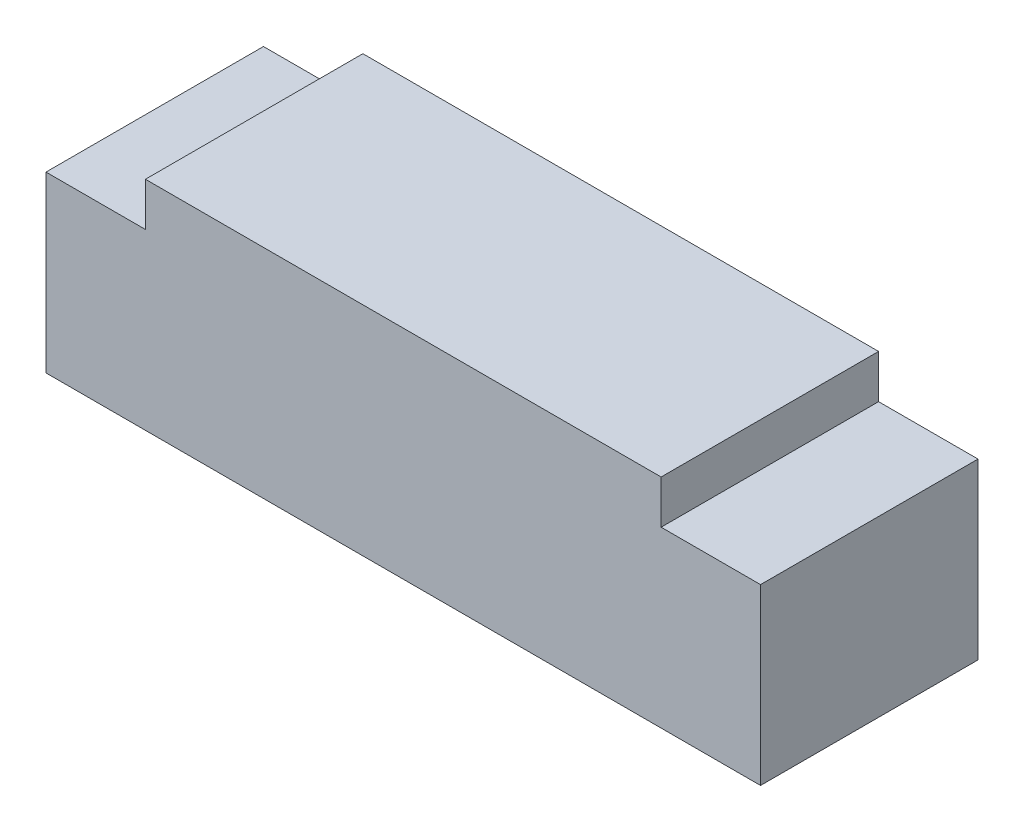
ISO-10303-21;
HEADER;
FILE_DESCRIPTION(('STEP AP214'),'2;1');
FILE_NAME('part.step','',(''),(''),'','','');
FILE_SCHEMA(('AUTOMOTIVE_DESIGN { 1 0 10303 214 1 1 1 1 }'));
ENDSEC;
DATA;
#1=APPLICATION_CONTEXT('core data for automotive mechanical design processes');
#2=APPLICATION_PROTOCOL_DEFINITION('international standard','automotive_design',2000,#1);
#3=PRODUCT_CONTEXT('',#1,'mechanical');
#4=PRODUCT('Part','Part','',(#3));
#5=PRODUCT_RELATED_PRODUCT_CATEGORY('part','',(#4));
#6=PRODUCT_DEFINITION_FORMATION('','',#4);
#7=PRODUCT_DEFINITION_CONTEXT('part definition',#1,'design');
#8=PRODUCT_DEFINITION('design','',#6,#7);
#9=PRODUCT_DEFINITION_SHAPE('','',#8);
#10=(LENGTH_UNIT() NAMED_UNIT(*) SI_UNIT(.MILLI.,.METRE.));
#11=(NAMED_UNIT(*) PLANE_ANGLE_UNIT() SI_UNIT($,.RADIAN.));
#12=(NAMED_UNIT(*) SI_UNIT($,.STERADIAN.) SOLID_ANGLE_UNIT());
#13=UNCERTAINTY_MEASURE_WITH_UNIT(LENGTH_MEASURE(1.E-05),#10,'distance_accuracy_value','');
#14=(GEOMETRIC_REPRESENTATION_CONTEXT(3) GLOBAL_UNCERTAINTY_ASSIGNED_CONTEXT((#13)) GLOBAL_UNIT_ASSIGNED_CONTEXT((#10,
#11,#12)) REPRESENTATION_CONTEXT('',''));
#15=CARTESIAN_POINT('',(0.,0.,0.));
#16=DIRECTION('',(0.,0.,1.));
#17=DIRECTION('',(1.,0.,0.));
#18=AXIS2_PLACEMENT_3D('',#15,#16,#17);
#19=CARTESIAN_POINT('',(0.,5.00000000000402,-19.95));
#20=DIRECTION('',(0.,1.,0.));
#21=DIRECTION('',(1.,0.,0.));
#22=AXIS2_PLACEMENT_3D('',#19,#20,#21);
#23=PLANE('',#22);
#24=DIRECTION('',(-1.,0.,0.));
#25=VECTOR('',#24,1.);
#26=CARTESIAN_POINT('',(5.75,5.00000000000402,-21.7));
#27=LINE('',#26,#25);
#28=CARTESIAN_POINT('',(5.75,5.00000000000402,-21.7));
#29=VERTEX_POINT('',#28);
#30=CARTESIAN_POINT('',(-5.75,5.00000000000402,-21.7));
#31=VERTEX_POINT('',#30);
#32=EDGE_CURVE('E29',#29,#31,#27,.T.);
#33=ORIENTED_EDGE('',*,*,#32,.F.);
#34=DIRECTION('',(0.,0.,-1.));
#35=VECTOR('',#34,1.);
#36=CARTESIAN_POINT('',(5.75,5.00000000000402,-18.2));
#37=LINE('',#36,#35);
#38=CARTESIAN_POINT('',(5.75,5.00000000000402,-18.2));
#39=VERTEX_POINT('',#38);
#40=EDGE_CURVE('E143',#39,#29,#37,.T.);
#41=ORIENTED_EDGE('',*,*,#40,.F.);
#42=DIRECTION('',(-1.,0.,0.));
#43=VECTOR('',#42,1.);
#44=CARTESIAN_POINT('',(-4.15,5.00000000000402,-18.2));
#45=LINE('',#44,#43);
#46=CARTESIAN_POINT('',(-5.75,5.00000000000402,-18.2));
#47=VERTEX_POINT('',#46);
#48=EDGE_CURVE('E150',#39,#47,#45,.T.);
#49=ORIENTED_EDGE('',*,*,#48,.T.);
#50=DIRECTION('',(0.,0.,-1.));
#51=VECTOR('',#50,1.);
#52=CARTESIAN_POINT('',(-5.75,5.00000000000402,-18.2));
#53=LINE('',#52,#51);
#54=EDGE_CURVE('E122',#47,#31,#53,.T.);
#55=ORIENTED_EDGE('',*,*,#54,.T.);
#56=EDGE_LOOP('',(#33,#41,#49,#55));
#57=FACE_BOUND('',#56,.T.);
#58=ADVANCED_FACE('F18',(#57),#23,.F.);
#59=CARTESIAN_POINT('',(0.,8.50000000000401,-19.95));
#60=DIRECTION('',(0.,1.,0.));
#61=DIRECTION('',(1.,0.,0.));
#62=AXIS2_PLACEMENT_3D('',#59,#60,#61);
#63=PLANE('',#62);
#64=DIRECTION('',(-1.,0.,0.));
#65=VECTOR('',#64,1.);
#66=CARTESIAN_POINT('',(5.75,8.50000000000401,-21.7));
#67=LINE('',#66,#65);
#68=CARTESIAN_POINT('',(4.15,8.50000000000401,-21.7));
#69=VERTEX_POINT('',#68);
#70=CARTESIAN_POINT('',(-4.15,8.50000000000401,-21.7));
#71=VERTEX_POINT('',#70);
#72=EDGE_CURVE('E11',#69,#71,#67,.T.);
#73=ORIENTED_EDGE('',*,*,#72,.T.);
#74=DIRECTION('',(0.,0.,1.));
#75=VECTOR('',#74,1.);
#76=CARTESIAN_POINT('',(-4.15,8.50000000000401,-21.7));
#77=LINE('',#76,#75);
#78=CARTESIAN_POINT('',(-4.15,8.50000000000401,-18.2));
#79=VERTEX_POINT('',#78);
#80=EDGE_CURVE('E175',#71,#79,#77,.T.);
#81=ORIENTED_EDGE('',*,*,#80,.T.);
#82=DIRECTION('',(1.,0.,0.));
#83=VECTOR('',#82,1.);
#84=CARTESIAN_POINT('',(-4.15,8.50000000000401,-18.2));
#85=LINE('',#84,#83);
#86=CARTESIAN_POINT('',(4.15,8.50000000000401,-18.2));
#87=VERTEX_POINT('',#86);
#88=EDGE_CURVE('E159',#79,#87,#85,.T.);
#89=ORIENTED_EDGE('',*,*,#88,.T.);
#90=DIRECTION('',(0.,0.,-1.));
#91=VECTOR('',#90,1.);
#92=CARTESIAN_POINT('',(4.15,8.50000000000401,-21.7));
#93=LINE('',#92,#91);
#94=EDGE_CURVE('E151',#87,#69,#93,.T.);
#95=ORIENTED_EDGE('',*,*,#94,.T.);
#96=EDGE_LOOP('',(#73,#81,#89,#95));
#97=FACE_BOUND('',#96,.T.);
#98=ADVANCED_FACE('F254',(#97),#63,.T.);
#99=CARTESIAN_POINT('',(4.15,5.00000000000402,-21.7));
#100=DIRECTION('',(0.,0.,-1.));
#101=DIRECTION('',(0.,-1.,0.));
#102=AXIS2_PLACEMENT_3D('',#99,#100,#101);
#103=PLANE('',#102);
#104=ORIENTED_EDGE('',*,*,#32,.T.);
#105=DIRECTION('',(0.,1.,0.));
#106=VECTOR('',#105,1.);
#107=CARTESIAN_POINT('',(-5.75,5.00000000000402,-21.7));
#108=LINE('',#107,#106);
#109=CARTESIAN_POINT('',(-5.75,7.80000000000402,-21.7));
#110=VERTEX_POINT('',#109);
#111=EDGE_CURVE('E118',#31,#110,#108,.T.);
#112=ORIENTED_EDGE('',*,*,#111,.T.);
#113=DIRECTION('',(-1.,0.,0.));
#114=VECTOR('',#113,1.);
#115=CARTESIAN_POINT('',(-5.75,7.80000000000402,-21.7));
#116=LINE('',#115,#114);
#117=CARTESIAN_POINT('',(-4.15,7.80000000000402,-21.7));
#118=VERTEX_POINT('',#117);
#119=EDGE_CURVE('E108',#118,#110,#116,.T.);
#120=ORIENTED_EDGE('',*,*,#119,.F.);
#121=DIRECTION('',(0.,1.,0.));
#122=VECTOR('',#121,1.);
#123=CARTESIAN_POINT('',(-4.15,5.00000000000402,-21.7));
#124=LINE('',#123,#122);
#125=EDGE_CURVE('E132',#118,#71,#124,.T.);
#126=ORIENTED_EDGE('',*,*,#125,.T.);
#127=ORIENTED_EDGE('',*,*,#72,.F.);
#128=DIRECTION('',(0.,1.,0.));
#129=VECTOR('',#128,1.);
#130=CARTESIAN_POINT('',(4.15,5.00000000000402,-21.7));
#131=LINE('',#130,#129);
#132=CARTESIAN_POINT('',(4.15,7.80000000000402,-21.7));
#133=VERTEX_POINT('',#132);
#134=EDGE_CURVE('E162',#133,#69,#131,.T.);
#135=ORIENTED_EDGE('',*,*,#134,.F.);
#136=DIRECTION('',(-1.,0.,0.));
#137=VECTOR('',#136,1.);
#138=CARTESIAN_POINT('',(5.75,7.80000000000402,-21.7));
#139=LINE('',#138,#137);
#140=CARTESIAN_POINT('',(5.75,7.80000000000402,-21.7));
#141=VERTEX_POINT('',#140);
#142=EDGE_CURVE('E167',#141,#133,#139,.T.);
#143=ORIENTED_EDGE('',*,*,#142,.F.);
#144=DIRECTION('',(0.,1.,0.));
#145=VECTOR('',#144,1.);
#146=CARTESIAN_POINT('',(5.75,5.00000000000402,-21.7));
#147=LINE('',#146,#145);
#148=EDGE_CURVE('E138',#29,#141,#147,.T.);
#149=ORIENTED_EDGE('',*,*,#148,.F.);
#150=EDGE_LOOP('',(#104,#112,#120,#126,#127,#135,#143,#149));
#151=FACE_BOUND('',#150,.T.);
#152=ADVANCED_FACE('F187',(#151),#103,.T.);
#153=CARTESIAN_POINT('',(-4.15,5.00000000000402,-21.7));
#154=DIRECTION('',(-1.,0.,0.));
#155=DIRECTION('',(0.,0.,1.));
#156=AXIS2_PLACEMENT_3D('',#153,#154,#155);
#157=PLANE('',#156);
#158=DIRECTION('',(0.,0.,1.));
#159=VECTOR('',#158,1.);
#160=CARTESIAN_POINT('',(-4.15,7.80000000000402,-20.825));
#161=LINE('',#160,#159);
#162=CARTESIAN_POINT('',(-4.15,7.80000000000402,-18.2));
#163=VERTEX_POINT('',#162);
#164=EDGE_CURVE('E107',#118,#163,#161,.T.);
#165=ORIENTED_EDGE('',*,*,#164,.T.);
#166=DIRECTION('',(0.,1.,0.));
#167=VECTOR('',#166,1.);
#168=CARTESIAN_POINT('',(-4.15,5.00000000000402,-18.2));
#169=LINE('',#168,#167);
#170=EDGE_CURVE('E102',#163,#79,#169,.T.);
#171=ORIENTED_EDGE('',*,*,#170,.T.);
#172=ORIENTED_EDGE('',*,*,#80,.F.);
#173=ORIENTED_EDGE('',*,*,#125,.F.);
#174=EDGE_LOOP('',(#165,#171,#172,#173));
#175=FACE_BOUND('',#174,.T.);
#176=ADVANCED_FACE('F185',(#175),#157,.T.);
#177=CARTESIAN_POINT('',(-4.15,5.00000000000402,-18.2));
#178=DIRECTION('',(0.,0.,1.));
#179=DIRECTION('',(1.,0.,0.));
#180=AXIS2_PLACEMENT_3D('',#177,#178,#179);
#181=PLANE('',#180);
#182=ORIENTED_EDGE('',*,*,#48,.F.);
#183=DIRECTION('',(0.,1.,0.));
#184=VECTOR('',#183,1.);
#185=CARTESIAN_POINT('',(5.75,5.00000000000402,-18.2));
#186=LINE('',#185,#184);
#187=CARTESIAN_POINT('',(5.75,7.80000000000402,-18.2));
#188=VERTEX_POINT('',#187);
#189=EDGE_CURVE('E146',#39,#188,#186,.T.);
#190=ORIENTED_EDGE('',*,*,#189,.T.);
#191=DIRECTION('',(1.,0.,0.));
#192=VECTOR('',#191,1.);
#193=CARTESIAN_POINT('',(4.15,7.80000000000402,-18.2));
#194=LINE('',#193,#192);
#195=CARTESIAN_POINT('',(4.15,7.80000000000402,-18.2));
#196=VERTEX_POINT('',#195);
#197=EDGE_CURVE('E22',#196,#188,#194,.T.);
#198=ORIENTED_EDGE('',*,*,#197,.F.);
#199=DIRECTION('',(0.,1.,0.));
#200=VECTOR('',#199,1.);
#201=CARTESIAN_POINT('',(4.15,5.00000000000402,-18.2));
#202=LINE('',#201,#200);
#203=EDGE_CURVE('E147',#196,#87,#202,.T.);
#204=ORIENTED_EDGE('',*,*,#203,.T.);
#205=ORIENTED_EDGE('',*,*,#88,.F.);
#206=ORIENTED_EDGE('',*,*,#170,.F.);
#207=DIRECTION('',(1.,0.,0.));
#208=VECTOR('',#207,1.);
#209=CARTESIAN_POINT('',(-4.15,7.80000000000402,-18.2));
#210=LINE('',#209,#208);
#211=CARTESIAN_POINT('',(-5.75,7.80000000000402,-18.2));
#212=VERTEX_POINT('',#211);
#213=EDGE_CURVE('E93',#212,#163,#210,.T.);
#214=ORIENTED_EDGE('',*,*,#213,.F.);
#215=DIRECTION('',(0.,1.,0.));
#216=VECTOR('',#215,1.);
#217=CARTESIAN_POINT('',(-5.75,5.00000000000402,-18.2));
#218=LINE('',#217,#216);
#219=EDGE_CURVE('E98',#47,#212,#218,.T.);
#220=ORIENTED_EDGE('',*,*,#219,.F.);
#221=EDGE_LOOP('',(#182,#190,#198,#204,#205,#206,#214,#220));
#222=FACE_BOUND('',#221,.T.);
#223=ADVANCED_FACE('F96',(#222),#181,.T.);
#224=CARTESIAN_POINT('',(4.15,5.00000000000402,-18.2));
#225=DIRECTION('',(1.,0.,0.));
#226=DIRECTION('',(0.,1.,0.));
#227=AXIS2_PLACEMENT_3D('',#224,#225,#226);
#228=PLANE('',#227);
#229=DIRECTION('',(0.,0.,-1.));
#230=VECTOR('',#229,1.);
#231=CARTESIAN_POINT('',(4.15,7.80000000000402,-19.075));
#232=LINE('',#231,#230);
#233=EDGE_CURVE('E193',#196,#133,#232,.T.);
#234=ORIENTED_EDGE('',*,*,#233,.T.);
#235=ORIENTED_EDGE('',*,*,#134,.T.);
#236=ORIENTED_EDGE('',*,*,#94,.F.);
#237=ORIENTED_EDGE('',*,*,#203,.F.);
#238=EDGE_LOOP('',(#234,#235,#236,#237));
#239=FACE_BOUND('',#238,.T.);
#240=ADVANCED_FACE('F210',(#239),#228,.T.);
#241=CARTESIAN_POINT('',(4.95,7.80000000000402,-19.95));
#242=DIRECTION('',(0.,1.,0.));
#243=DIRECTION('',(1.,0.,0.));
#244=AXIS2_PLACEMENT_3D('',#241,#242,#243);
#245=PLANE('',#244);
#246=ORIENTED_EDGE('',*,*,#233,.F.);
#247=ORIENTED_EDGE('',*,*,#197,.T.);
#248=DIRECTION('',(0.,0.,-1.));
#249=VECTOR('',#248,1.);
#250=CARTESIAN_POINT('',(5.75,7.80000000000402,-18.2));
#251=LINE('',#250,#249);
#252=EDGE_CURVE('E142',#188,#141,#251,.T.);
#253=ORIENTED_EDGE('',*,*,#252,.T.);
#254=ORIENTED_EDGE('',*,*,#142,.T.);
#255=EDGE_LOOP('',(#246,#247,#253,#254));
#256=FACE_BOUND('',#255,.T.);
#257=ADVANCED_FACE('F20',(#256),#245,.T.);
#258=CARTESIAN_POINT('',(5.75,5.00000000000402,-18.2));
#259=DIRECTION('',(1.,0.,0.));
#260=DIRECTION('',(0.,1.,0.));
#261=AXIS2_PLACEMENT_3D('',#258,#259,#260);
#262=PLANE('',#261);
#263=ORIENTED_EDGE('',*,*,#40,.T.);
#264=ORIENTED_EDGE('',*,*,#148,.T.);
#265=ORIENTED_EDGE('',*,*,#252,.F.);
#266=ORIENTED_EDGE('',*,*,#189,.F.);
#267=EDGE_LOOP('',(#263,#264,#265,#266));
#268=FACE_BOUND('',#267,.T.);
#269=ADVANCED_FACE('F252',(#268),#262,.T.);
#270=CARTESIAN_POINT('',(-4.95,7.80000000000402,-19.95));
#271=DIRECTION('',(0.,1.,0.));
#272=DIRECTION('',(1.,0.,0.));
#273=AXIS2_PLACEMENT_3D('',#270,#271,#272);
#274=PLANE('',#273);
#275=ORIENTED_EDGE('',*,*,#119,.T.);
#276=DIRECTION('',(0.,0.,1.));
#277=VECTOR('',#276,1.);
#278=CARTESIAN_POINT('',(-5.75,7.80000000000402,-18.2));
#279=LINE('',#278,#277);
#280=EDGE_CURVE('E111',#110,#212,#279,.T.);
#281=ORIENTED_EDGE('',*,*,#280,.T.);
#282=ORIENTED_EDGE('',*,*,#213,.T.);
#283=ORIENTED_EDGE('',*,*,#164,.F.);
#284=EDGE_LOOP('',(#275,#281,#282,#283));
#285=FACE_BOUND('',#284,.T.);
#286=ADVANCED_FACE('F112',(#285),#274,.T.);
#287=CARTESIAN_POINT('',(-5.75,5.00000000000402,-21.7));
#288=DIRECTION('',(-1.,0.,0.));
#289=DIRECTION('',(0.,0.,1.));
#290=AXIS2_PLACEMENT_3D('',#287,#288,#289);
#291=PLANE('',#290);
#292=ORIENTED_EDGE('',*,*,#54,.F.);
#293=ORIENTED_EDGE('',*,*,#219,.T.);
#294=ORIENTED_EDGE('',*,*,#280,.F.);
#295=ORIENTED_EDGE('',*,*,#111,.F.);
#296=EDGE_LOOP('',(#292,#293,#294,#295));
#297=FACE_BOUND('',#296,.T.);
#298=ADVANCED_FACE('F120',(#297),#291,.T.);
#299=CLOSED_SHELL('',(#58,#98,#152,#176,#223,#240,#257,#269,#286,#298));
#300=MANIFOLD_SOLID_BREP('B1',#299);
#301=ADVANCED_BREP_SHAPE_REPRESENTATION('',(#18,#300),#14);
#302=SHAPE_DEFINITION_REPRESENTATION(#9,#301);
ENDSEC;
END-ISO-10303-21;
